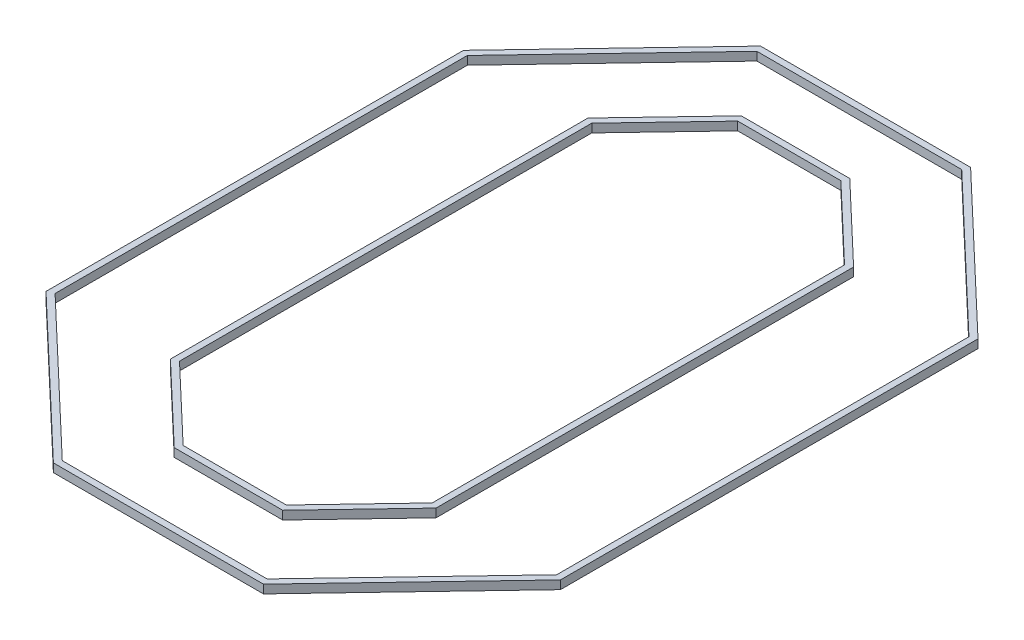
ISO-10303-21;
HEADER;
FILE_DESCRIPTION(('STEP AP214'),'2;1');
FILE_NAME('part.step','',(''),(''),'','','');
FILE_SCHEMA(('AUTOMOTIVE_DESIGN { 1 0 10303 214 1 1 1 1 }'));
ENDSEC;
DATA;
#1=APPLICATION_CONTEXT('core data for automotive mechanical design processes');
#2=APPLICATION_PROTOCOL_DEFINITION('international standard','automotive_design',2000,#1);
#3=PRODUCT_CONTEXT('',#1,'mechanical');
#4=PRODUCT('Part','Part','',(#3));
#5=PRODUCT_RELATED_PRODUCT_CATEGORY('part','',(#4));
#6=PRODUCT_DEFINITION_FORMATION('','',#4);
#7=PRODUCT_DEFINITION_CONTEXT('part definition',#1,'design');
#8=PRODUCT_DEFINITION('design','',#6,#7);
#9=PRODUCT_DEFINITION_SHAPE('','',#8);
#10=(LENGTH_UNIT() NAMED_UNIT(*) SI_UNIT(.MILLI.,.METRE.));
#11=(NAMED_UNIT(*) PLANE_ANGLE_UNIT() SI_UNIT($,.RADIAN.));
#12=(NAMED_UNIT(*) SI_UNIT($,.STERADIAN.) SOLID_ANGLE_UNIT());
#13=UNCERTAINTY_MEASURE_WITH_UNIT(LENGTH_MEASURE(1.E-05),#10,'distance_accuracy_value','');
#14=(GEOMETRIC_REPRESENTATION_CONTEXT(3) GLOBAL_UNCERTAINTY_ASSIGNED_CONTEXT((#13)) GLOBAL_UNIT_ASSIGNED_CONTEXT((#10,
#11,#12)) REPRESENTATION_CONTEXT('',''));
#15=CARTESIAN_POINT('',(0.,0.,0.));
#16=DIRECTION('',(0.,0.,1.));
#17=DIRECTION('',(1.,0.,0.));
#18=AXIS2_PLACEMENT_3D('',#15,#16,#17);
#19=CARTESIAN_POINT('',(-2041.11670156497,101.6,-1941.93514676379));
#20=DIRECTION('',(0.724489795918367,0.,0.689285525461084));
#21=DIRECTION('',(0.689285525461084,0.,-0.724489795918367));
#22=AXIS2_PLACEMENT_3D('',#19,#20,#21);
#23=PLANE('',#22);
#24=DIRECTION('',(-0.689285525461084,0.,0.724489795918367));
#25=VECTOR('',#24,1.);
#26=CARTESIAN_POINT('',(-2041.11670156497,0.,-1941.93514676379));
#27=LINE('',#26,#25);
#28=CARTESIAN_POINT('',(-651.340080352583,0.,-3402.69261733558));
#29=VERTEX_POINT('',#28);
#30=CARTESIAN_POINT('',(-1548.49261733558,0.,-2459.7193001581));
#31=VERTEX_POINT('',#30);
#32=EDGE_CURVE('E270',#29,#31,#27,.T.);
#33=ORIENTED_EDGE('',*,*,#32,.T.);
#34=DIRECTION('',(0.,-1.,0.));
#35=VECTOR('',#34,1.);
#36=CARTESIAN_POINT('',(-1548.49261733558,101.6,-2459.7193001581));
#37=LINE('',#36,#35);
#38=CARTESIAN_POINT('',(-1548.49261733558,101.6,-2459.7193001581));
#39=VERTEX_POINT('',#38);
#40=EDGE_CURVE('E13',#39,#31,#37,.T.);
#41=ORIENTED_EDGE('',*,*,#40,.F.);
#42=DIRECTION('',(-0.689285525461084,0.,0.724489795918367));
#43=VECTOR('',#42,1.);
#44=CARTESIAN_POINT('',(-2041.11670156497,101.6,-1941.93514676379));
#45=LINE('',#44,#43);
#46=CARTESIAN_POINT('',(-651.340080352583,101.6,-3402.69261733558));
#47=VERTEX_POINT('',#46);
#48=EDGE_CURVE('E350',#47,#39,#45,.T.);
#49=ORIENTED_EDGE('',*,*,#48,.F.);
#50=DIRECTION('',(0.,-1.,0.));
#51=VECTOR('',#50,1.);
#52=CARTESIAN_POINT('',(-651.340080352583,101.6,-3402.69261733558));
#53=LINE('',#52,#51);
#54=EDGE_CURVE('E289',#47,#29,#53,.T.);
#55=ORIENTED_EDGE('',*,*,#54,.T.);
#56=EDGE_LOOP('',(#33,#41,#49,#55));
#57=FACE_BOUND('',#56,.T.);
#58=ADVANCED_FACE('F99',(#57),#23,.F.);
#59=CARTESIAN_POINT('',(-1548.49261733558,101.6,-9.61033946544975E-13));
#60=DIRECTION('',(1.,0.,0.));
#61=DIRECTION('',(0.,0.,-1.));
#62=AXIS2_PLACEMENT_3D('',#59,#60,#61);
#63=PLANE('',#62);
#64=DIRECTION('',(0.,0.,1.));
#65=VECTOR('',#64,1.);
#66=CARTESIAN_POINT('',(-1548.49261733558,0.,-9.61033946544975E-13));
#67=LINE('',#66,#65);
#68=CARTESIAN_POINT('',(-1548.49261733558,0.,2550.24950383333));
#69=VERTEX_POINT('',#68);
#70=EDGE_CURVE('E273',#31,#69,#67,.T.);
#71=ORIENTED_EDGE('',*,*,#70,.T.);
#72=DIRECTION('',(0.,-1.,0.));
#73=VECTOR('',#72,1.);
#74=CARTESIAN_POINT('',(-1548.49261733558,101.6,2550.24950383333));
#75=LINE('',#74,#73);
#76=CARTESIAN_POINT('',(-1548.49261733558,101.6,2550.24950383333));
#77=VERTEX_POINT('',#76);
#78=EDGE_CURVE('E109',#77,#69,#75,.T.);
#79=ORIENTED_EDGE('',*,*,#78,.F.);
#80=DIRECTION('',(0.,0.,1.));
#81=VECTOR('',#80,1.);
#82=CARTESIAN_POINT('',(-1548.49261733558,101.6,-9.61033946544975E-13));
#83=LINE('',#82,#81);
#84=EDGE_CURVE('E352',#39,#77,#83,.T.);
#85=ORIENTED_EDGE('',*,*,#84,.F.);
#86=ORIENTED_EDGE('',*,*,#40,.T.);
#87=EDGE_LOOP('',(#71,#79,#85,#86));
#88=FACE_BOUND('',#87,.T.);
#89=ADVANCED_FACE('F384',(#88),#63,.F.);
#90=CARTESIAN_POINT('',(-2009.2557887482,101.6,2111.87564886733));
#91=DIRECTION('',(-0.689285525461084,0.,0.724489795918367));
#92=DIRECTION('',(0.724489795918367,0.,0.689285525461084));
#93=AXIS2_PLACEMENT_3D('',#90,#91,#92);
#94=PLANE('',#93);
#95=DIRECTION('',(-0.724489795918367,0.,-0.689285525461084));
#96=VECTOR('',#95,1.);
#97=CARTESIAN_POINT('',(-2009.2557887482,0.,2111.87564886733));
#98=LINE('',#97,#96);
#99=CARTESIAN_POINT('',(-605.519300158103,0.,3447.40204081633));
#100=VERTEX_POINT('',#99);
#101=EDGE_CURVE('E276',#100,#69,#98,.T.);
#102=ORIENTED_EDGE('',*,*,#101,.F.);
#103=DIRECTION('',(0.,-1.,0.));
#104=VECTOR('',#103,1.);
#105=CARTESIAN_POINT('',(-605.519300158103,101.6,3447.40204081633));
#106=LINE('',#105,#104);
#107=CARTESIAN_POINT('',(-605.519300158103,101.6,3447.40204081633));
#108=VERTEX_POINT('',#107);
#109=EDGE_CURVE('E295',#108,#100,#106,.T.);
#110=ORIENTED_EDGE('',*,*,#109,.F.);
#111=DIRECTION('',(-0.724489795918367,0.,-0.689285525461084));
#112=VECTOR('',#111,1.);
#113=CARTESIAN_POINT('',(-2009.2557887482,101.6,2111.87564886733));
#114=LINE('',#113,#112);
#115=EDGE_CURVE('E354',#108,#77,#114,.T.);
#116=ORIENTED_EDGE('',*,*,#115,.T.);
#117=ORIENTED_EDGE('',*,*,#78,.T.);
#118=EDGE_LOOP('',(#102,#110,#116,#117));
#119=FACE_BOUND('',#118,.T.);
#120=ADVANCED_FACE('F389',(#119),#94,.T.);
#121=CARTESIAN_POINT('',(0.,101.6,3447.40204081633));
#122=DIRECTION('',(0.,0.,1.));
#123=DIRECTION('',(1.,0.,0.));
#124=AXIS2_PLACEMENT_3D('',#121,#122,#123);
#125=PLANE('',#124);
#126=DIRECTION('',(-1.,0.,0.));
#127=VECTOR('',#126,1.);
#128=CARTESIAN_POINT('',(0.,0.,3447.40204081633));
#129=LINE('',#128,#127);
#130=CARTESIAN_POINT('',(696.049503833336,0.,3447.40204081633));
#131=VERTEX_POINT('',#130);
#132=EDGE_CURVE('E279',#131,#100,#129,.T.);
#133=ORIENTED_EDGE('',*,*,#132,.F.);
#134=DIRECTION('',(0.,-1.,0.));
#135=VECTOR('',#134,1.);
#136=CARTESIAN_POINT('',(696.049503833336,101.6,3447.40204081633));
#137=LINE('',#136,#135);
#138=CARTESIAN_POINT('',(696.049503833336,101.6,3447.40204081633));
#139=VERTEX_POINT('',#138);
#140=EDGE_CURVE('E293',#139,#131,#137,.T.);
#141=ORIENTED_EDGE('',*,*,#140,.F.);
#142=DIRECTION('',(-1.,0.,0.));
#143=VECTOR('',#142,1.);
#144=CARTESIAN_POINT('',(0.,101.6,3447.40204081633));
#145=LINE('',#144,#143);
#146=EDGE_CURVE('E243',#139,#108,#145,.T.);
#147=ORIENTED_EDGE('',*,*,#146,.T.);
#148=ORIENTED_EDGE('',*,*,#109,.T.);
#149=EDGE_LOOP('',(#133,#141,#147,#148));
#150=FACE_BOUND('',#149,.T.);
#151=ADVANCED_FACE('F359',(#150),#125,.T.);
#152=CARTESIAN_POINT('',(2086.91103470847,101.6,1985.50425037545));
#153=DIRECTION('',(0.724489795918368,0.,0.689285525461083));
#154=DIRECTION('',(0.689285525461083,0.,-0.724489795918368));
#155=AXIS2_PLACEMENT_3D('',#152,#153,#154);
#156=PLANE('',#155);
#157=DIRECTION('',(-0.689285525461083,0.,0.724489795918368));
#158=VECTOR('',#157,1.);
#159=CARTESIAN_POINT('',(2086.91103470847,0.,1985.50425037545));
#160=LINE('',#159,#158);
#161=CARTESIAN_POINT('',(1593.20204081633,0.,2504.42872363886));
#162=VERTEX_POINT('',#161);
#163=EDGE_CURVE('E282',#162,#131,#160,.T.);
#164=ORIENTED_EDGE('',*,*,#163,.F.);
#165=DIRECTION('',(0.,-1.,0.));
#166=VECTOR('',#165,1.);
#167=CARTESIAN_POINT('',(1593.20204081633,101.6,2504.42872363886));
#168=LINE('',#167,#166);
#169=CARTESIAN_POINT('',(1593.20204081633,101.6,2504.42872363886));
#170=VERTEX_POINT('',#169);
#171=EDGE_CURVE('E231',#170,#162,#168,.T.);
#172=ORIENTED_EDGE('',*,*,#171,.F.);
#173=DIRECTION('',(-0.689285525461083,0.,0.724489795918368));
#174=VECTOR('',#173,1.);
#175=CARTESIAN_POINT('',(2086.91103470847,101.6,1985.50425037545));
#176=LINE('',#175,#174);
#177=EDGE_CURVE('E241',#170,#139,#176,.T.);
#178=ORIENTED_EDGE('',*,*,#177,.T.);
#179=ORIENTED_EDGE('',*,*,#140,.T.);
#180=EDGE_LOOP('',(#164,#172,#178,#179));
#181=FACE_BOUND('',#180,.T.);
#182=ADVANCED_FACE('F364',(#181),#156,.T.);
#183=CARTESIAN_POINT('',(1593.20204081633,101.6,0.));
#184=DIRECTION('',(1.,0.,0.));
#185=DIRECTION('',(0.,0.,-1.));
#186=AXIS2_PLACEMENT_3D('',#183,#184,#185);
#187=PLANE('',#186);
#188=DIRECTION('',(0.,0.,1.));
#189=VECTOR('',#188,1.);
#190=CARTESIAN_POINT('',(1593.20204081633,0.,0.));
#191=LINE('',#190,#189);
#192=CARTESIAN_POINT('',(1593.20204081633,0.,-2505.54008035258));
#193=VERTEX_POINT('',#192);
#194=EDGE_CURVE('E230',#193,#162,#191,.T.);
#195=ORIENTED_EDGE('',*,*,#194,.F.);
#196=DIRECTION('',(0.,-1.,0.));
#197=VECTOR('',#196,1.);
#198=CARTESIAN_POINT('',(1593.20204081633,101.6,-2505.54008035258));
#199=LINE('',#198,#197);
#200=CARTESIAN_POINT('',(1593.20204081633,101.6,-2505.54008035258));
#201=VERTEX_POINT('',#200);
#202=EDGE_CURVE('E224',#201,#193,#199,.T.);
#203=ORIENTED_EDGE('',*,*,#202,.F.);
#204=DIRECTION('',(0.,0.,1.));
#205=VECTOR('',#204,1.);
#206=CARTESIAN_POINT('',(1593.20204081633,101.6,0.));
#207=LINE('',#206,#205);
#208=EDGE_CURVE('E228',#201,#170,#207,.T.);
#209=ORIENTED_EDGE('',*,*,#208,.T.);
#210=ORIENTED_EDGE('',*,*,#171,.T.);
#211=EDGE_LOOP('',(#195,#203,#209,#210));
#212=FACE_BOUND('',#211,.T.);
#213=ADVANCED_FACE('F226',(#212),#187,.T.);
#214=CARTESIAN_POINT('',(2008.17087908545,101.6,-2110.73532899824));
#215=DIRECTION('',(-0.689285525461084,0.,0.724489795918367));
#216=DIRECTION('',(0.724489795918368,0.,0.689285525461084));
#217=AXIS2_PLACEMENT_3D('',#214,#215,#216);
#218=PLANE('',#217);
#219=DIRECTION('',(-0.724489795918368,0.,-0.689285525461084));
#220=VECTOR('',#219,1.);
#221=CARTESIAN_POINT('',(2008.17087908545,0.,-2110.73532899824));
#222=LINE('',#221,#220);
#223=CARTESIAN_POINT('',(650.228723638856,0.,-3402.69261733558));
#224=VERTEX_POINT('',#223);
#225=EDGE_CURVE('E170',#193,#224,#222,.T.);
#226=ORIENTED_EDGE('',*,*,#225,.T.);
#227=DIRECTION('',(0.,-1.,0.));
#228=VECTOR('',#227,1.);
#229=CARTESIAN_POINT('',(650.228723638856,101.6,-3402.69261733558));
#230=LINE('',#229,#228);
#231=CARTESIAN_POINT('',(650.228723638856,101.6,-3402.69261733558));
#232=VERTEX_POINT('',#231);
#233=EDGE_CURVE('E232',#232,#224,#230,.T.);
#234=ORIENTED_EDGE('',*,*,#233,.F.);
#235=DIRECTION('',(-0.724489795918368,0.,-0.689285525461084));
#236=VECTOR('',#235,1.);
#237=CARTESIAN_POINT('',(2008.17087908545,101.6,-2110.73532899824));
#238=LINE('',#237,#236);
#239=EDGE_CURVE('E234',#201,#232,#238,.T.);
#240=ORIENTED_EDGE('',*,*,#239,.F.);
#241=ORIENTED_EDGE('',*,*,#202,.T.);
#242=EDGE_LOOP('',(#226,#234,#240,#241));
#243=FACE_BOUND('',#242,.T.);
#244=ADVANCED_FACE('F235',(#243),#218,.F.);
#245=CARTESIAN_POINT('',(-1472.29261733558,101.6,-9.24991510498918E-13));
#246=DIRECTION('',(1.,0.,0.));
#247=DIRECTION('',(0.,0.,-1.));
#248=AXIS2_PLACEMENT_3D('',#245,#246,#247);
#249=PLANE('',#248);
#250=DIRECTION('',(0.,0.,1.));
#251=VECTOR('',#250,1.);
#252=CARTESIAN_POINT('',(-1472.29261733558,0.,-9.24991510498918E-13));
#253=LINE('',#252,#251);
#254=CARTESIAN_POINT('',(-1472.29261733558,0.,-2429.26185288039));
#255=VERTEX_POINT('',#254);
#256=CARTESIAN_POINT('',(-1472.29261733558,0.,2517.56934312816));
#257=VERTEX_POINT('',#256);
#258=EDGE_CURVE('E249',#255,#257,#253,.T.);
#259=ORIENTED_EDGE('',*,*,#258,.F.);
#260=DIRECTION('',(0.,-1.,0.));
#261=VECTOR('',#260,1.);
#262=CARTESIAN_POINT('',(-1472.29261733558,101.6,-2429.26185288039));
#263=LINE('',#262,#261);
#264=CARTESIAN_POINT('',(-1472.29261733558,101.6,-2429.26185288039));
#265=VERTEX_POINT('',#264);
#266=EDGE_CURVE('E103',#265,#255,#263,.T.);
#267=ORIENTED_EDGE('',*,*,#266,.F.);
#268=DIRECTION('',(0.,0.,1.));
#269=VECTOR('',#268,1.);
#270=CARTESIAN_POINT('',(-1472.29261733558,101.6,-9.24991510498918E-13));
#271=LINE('',#270,#269);
#272=CARTESIAN_POINT('',(-1472.29261733558,101.6,2517.56934312816));
#273=VERTEX_POINT('',#272);
#274=EDGE_CURVE('E288',#265,#273,#271,.T.);
#275=ORIENTED_EDGE('',*,*,#274,.T.);
#276=DIRECTION('',(0.,-1.,0.));
#277=VECTOR('',#276,1.);
#278=CARTESIAN_POINT('',(-1472.29261733558,101.6,2517.56934312816));
#279=LINE('',#278,#277);
#280=EDGE_CURVE('E248',#273,#257,#279,.T.);
#281=ORIENTED_EDGE('',*,*,#280,.T.);
#282=EDGE_LOOP('',(#259,#267,#275,#281));
#283=FACE_BOUND('',#282,.T.);
#284=ADVANCED_FACE('F101',(#283),#249,.T.);
#285=CARTESIAN_POINT('',(-1985.91057911599,101.6,-1889.41158972365));
#286=DIRECTION('',(0.724489795918367,0.,0.689285525461084));
#287=DIRECTION('',(0.689285525461084,0.,-0.724489795918368));
#288=AXIS2_PLACEMENT_3D('',#285,#286,#287);
#289=PLANE('',#288);
#290=DIRECTION('',(-0.689285525461084,0.,0.724489795918368));
#291=VECTOR('',#290,1.);
#292=CARTESIAN_POINT('',(-1985.91057911599,0.,-1889.41158972365));
#293=LINE('',#292,#291);
#294=CARTESIAN_POINT('',(-618.659919647417,0.,-3326.49261733558));
#295=VERTEX_POINT('',#294);
#296=EDGE_CURVE('E252',#295,#255,#293,.T.);
#297=ORIENTED_EDGE('',*,*,#296,.F.);
#298=DIRECTION('',(0.,-1.,0.));
#299=VECTOR('',#298,1.);
#300=CARTESIAN_POINT('',(-618.659919647417,101.6,-3326.49261733558));
#301=LINE('',#300,#299);
#302=CARTESIAN_POINT('',(-618.659919647417,101.6,-3326.49261733558));
#303=VERTEX_POINT('',#302);
#304=EDGE_CURVE('E311',#303,#295,#301,.T.);
#305=ORIENTED_EDGE('',*,*,#304,.F.);
#306=DIRECTION('',(-0.689285525461084,0.,0.724489795918368));
#307=VECTOR('',#306,1.);
#308=CARTESIAN_POINT('',(-1985.91057911599,101.6,-1889.41158972365));
#309=LINE('',#308,#307);
#310=EDGE_CURVE('E320',#303,#265,#309,.T.);
#311=ORIENTED_EDGE('',*,*,#310,.T.);
#312=ORIENTED_EDGE('',*,*,#266,.T.);
#313=EDGE_LOOP('',(#297,#305,#311,#312));
#314=FACE_BOUND('',#313,.T.);
#315=ADVANCED_FACE('F318',(#314),#289,.T.);
#316=CARTESIAN_POINT('',(0.,101.6,-3326.49261733558));
#317=DIRECTION('',(0.,0.,1.));
#318=DIRECTION('',(1.,0.,0.));
#319=AXIS2_PLACEMENT_3D('',#316,#317,#318);
#320=PLANE('',#319);
#321=DIRECTION('',(-1.,0.,0.));
#322=VECTOR('',#321,1.);
#323=CARTESIAN_POINT('',(0.,0.,-3326.49261733558));
#324=LINE('',#323,#322);
#325=CARTESIAN_POINT('',(619.771276361145,0.,-3326.49261733558));
#326=VERTEX_POINT('',#325);
#327=EDGE_CURVE('E255',#326,#295,#324,.T.);
#328=ORIENTED_EDGE('',*,*,#327,.F.);
#329=DIRECTION('',(0.,-1.,0.));
#330=VECTOR('',#329,1.);
#331=CARTESIAN_POINT('',(619.771276361145,101.6,-3326.49261733558));
#332=LINE('',#331,#330);
#333=CARTESIAN_POINT('',(619.771276361145,101.6,-3326.49261733558));
#334=VERTEX_POINT('',#333);
#335=EDGE_CURVE('E310',#334,#326,#332,.T.);
#336=ORIENTED_EDGE('',*,*,#335,.F.);
#337=DIRECTION('',(-1.,0.,0.));
#338=VECTOR('',#337,1.);
#339=CARTESIAN_POINT('',(0.,101.6,-3326.49261733558));
#340=LINE('',#339,#338);
#341=EDGE_CURVE('E330',#334,#303,#340,.T.);
#342=ORIENTED_EDGE('',*,*,#341,.T.);
#343=ORIENTED_EDGE('',*,*,#304,.T.);
#344=EDGE_LOOP('',(#328,#336,#342,#343));
#345=FACE_BOUND('',#344,.T.);
#346=ADVANCED_FACE('F328',(#345),#320,.T.);
#347=CARTESIAN_POINT('',(1955.64732204532,101.6,-2055.52920654926));
#348=DIRECTION('',(-0.689285525461083,0.,0.724489795918368));
#349=DIRECTION('',(0.724489795918368,0.,0.689285525461084));
#350=AXIS2_PLACEMENT_3D('',#347,#348,#349);
#351=PLANE('',#350);
#352=DIRECTION('',(-0.724489795918368,0.,-0.689285525461084));
#353=VECTOR('',#352,1.);
#354=CARTESIAN_POINT('',(1955.64732204532,0.,-2055.52920654926));
#355=LINE('',#354,#353);
#356=CARTESIAN_POINT('',(1517.00204081633,0.,-2472.85991964742));
#357=VERTEX_POINT('',#356);
#358=EDGE_CURVE('E258',#357,#326,#355,.T.);
#359=ORIENTED_EDGE('',*,*,#358,.F.);
#360=DIRECTION('',(0.,-1.,0.));
#361=VECTOR('',#360,1.);
#362=CARTESIAN_POINT('',(1517.00204081633,101.6,-2472.85991964742));
#363=LINE('',#362,#361);
#364=CARTESIAN_POINT('',(1517.00204081633,101.6,-2472.85991964742));
#365=VERTEX_POINT('',#364);
#366=EDGE_CURVE('E308',#365,#357,#363,.T.);
#367=ORIENTED_EDGE('',*,*,#366,.F.);
#368=DIRECTION('',(-0.724489795918368,0.,-0.689285525461084));
#369=VECTOR('',#368,1.);
#370=CARTESIAN_POINT('',(1955.64732204532,101.6,-2055.52920654926));
#371=LINE('',#370,#369);
#372=EDGE_CURVE('E335',#365,#334,#371,.T.);
#373=ORIENTED_EDGE('',*,*,#372,.T.);
#374=ORIENTED_EDGE('',*,*,#335,.T.);
#375=EDGE_LOOP('',(#359,#367,#373,#374));
#376=FACE_BOUND('',#375,.T.);
#377=ADVANCED_FACE('F337',(#376),#351,.T.);
#378=CARTESIAN_POINT('',(1517.00204081633,101.6,-5.44862434215934E-13));
#379=DIRECTION('',(1.,0.,0.));
#380=DIRECTION('',(0.,0.,-1.));
#381=AXIS2_PLACEMENT_3D('',#378,#379,#380);
#382=PLANE('',#381);
#383=DIRECTION('',(0.,0.,1.));
#384=VECTOR('',#383,1.);
#385=CARTESIAN_POINT('',(1517.00204081633,0.,-5.44862434215934E-13));
#386=LINE('',#385,#384);
#387=CARTESIAN_POINT('',(1517.00204081633,0.,2473.97127636114));
#388=VERTEX_POINT('',#387);
#389=EDGE_CURVE('E261',#357,#388,#386,.T.);
#390=ORIENTED_EDGE('',*,*,#389,.T.);
#391=DIRECTION('',(0.,-1.,0.));
#392=VECTOR('',#391,1.);
#393=CARTESIAN_POINT('',(1517.00204081633,101.6,2473.97127636114));
#394=LINE('',#393,#392);
#395=CARTESIAN_POINT('',(1517.00204081633,101.6,2473.97127636114));
#396=VERTEX_POINT('',#395);
#397=EDGE_CURVE('E305',#396,#388,#394,.T.);
#398=ORIENTED_EDGE('',*,*,#397,.F.);
#399=DIRECTION('',(0.,0.,1.));
#400=VECTOR('',#399,1.);
#401=CARTESIAN_POINT('',(1517.00204081633,101.6,-5.44862434215934E-13));
#402=LINE('',#401,#400);
#403=EDGE_CURVE('E339',#365,#396,#402,.T.);
#404=ORIENTED_EDGE('',*,*,#403,.F.);
#405=ORIENTED_EDGE('',*,*,#366,.T.);
#406=EDGE_LOOP('',(#390,#398,#404,#405));
#407=FACE_BOUND('',#406,.T.);
#408=ADVANCED_FACE('F400',(#407),#382,.F.);
#409=CARTESIAN_POINT('',(2031.70491225949,101.6,1932.98069333532));
#410=DIRECTION('',(0.724489795918368,0.,0.689285525461083));
#411=DIRECTION('',(0.689285525461083,0.,-0.724489795918368));
#412=AXIS2_PLACEMENT_3D('',#409,#410,#411);
#413=PLANE('',#412);
#414=DIRECTION('',(-0.689285525461083,0.,0.724489795918368));
#415=VECTOR('',#414,1.);
#416=CARTESIAN_POINT('',(2031.70491225949,0.,1932.98069333532));
#417=LINE('',#416,#415);
#418=CARTESIAN_POINT('',(663.369343128169,0.,3371.20204081633));
#419=VERTEX_POINT('',#418);
#420=EDGE_CURVE('E263',#388,#419,#417,.T.);
#421=ORIENTED_EDGE('',*,*,#420,.T.);
#422=DIRECTION('',(0.,-1.,0.));
#423=VECTOR('',#422,1.);
#424=CARTESIAN_POINT('',(663.369343128169,101.6,3371.20204081633));
#425=LINE('',#424,#423);
#426=CARTESIAN_POINT('',(663.369343128169,101.6,3371.20204081633));
#427=VERTEX_POINT('',#426);
#428=EDGE_CURVE('E302',#427,#419,#425,.T.);
#429=ORIENTED_EDGE('',*,*,#428,.F.);
#430=DIRECTION('',(-0.689285525461083,0.,0.724489795918368));
#431=VECTOR('',#430,1.);
#432=CARTESIAN_POINT('',(2031.70491225949,101.6,1932.98069333532));
#433=LINE('',#432,#431);
#434=EDGE_CURVE('E341',#396,#427,#433,.T.);
#435=ORIENTED_EDGE('',*,*,#434,.F.);
#436=ORIENTED_EDGE('',*,*,#397,.T.);
#437=EDGE_LOOP('',(#421,#429,#435,#436));
#438=FACE_BOUND('',#437,.T.);
#439=ADVANCED_FACE('F396',(#438),#413,.F.);
#440=CARTESIAN_POINT('',(0.,101.6,3371.20204081633));
#441=DIRECTION('',(0.,0.,1.));
#442=DIRECTION('',(1.,0.,0.));
#443=AXIS2_PLACEMENT_3D('',#440,#441,#442);
#444=PLANE('',#443);
#445=DIRECTION('',(-1.,0.,0.));
#446=VECTOR('',#445,1.);
#447=CARTESIAN_POINT('',(0.,0.,3371.20204081633));
#448=LINE('',#447,#446);
#449=CARTESIAN_POINT('',(-575.061852880392,0.,3371.20204081633));
#450=VERTEX_POINT('',#449);
#451=EDGE_CURVE('E265',#419,#450,#448,.T.);
#452=ORIENTED_EDGE('',*,*,#451,.T.);
#453=DIRECTION('',(0.,-1.,0.));
#454=VECTOR('',#453,1.);
#455=CARTESIAN_POINT('',(-575.061852880392,101.6,3371.20204081633));
#456=LINE('',#455,#454);
#457=CARTESIAN_POINT('',(-575.061852880392,101.6,3371.20204081633));
#458=VERTEX_POINT('',#457);
#459=EDGE_CURVE('E299',#458,#450,#456,.T.);
#460=ORIENTED_EDGE('',*,*,#459,.F.);
#461=DIRECTION('',(-1.,0.,0.));
#462=VECTOR('',#461,1.);
#463=CARTESIAN_POINT('',(0.,101.6,3371.20204081633));
#464=LINE('',#463,#462);
#465=EDGE_CURVE('E346',#427,#458,#464,.T.);
#466=ORIENTED_EDGE('',*,*,#465,.F.);
#467=ORIENTED_EDGE('',*,*,#428,.T.);
#468=EDGE_LOOP('',(#452,#460,#466,#467));
#469=FACE_BOUND('',#468,.T.);
#470=ADVANCED_FACE('F378',(#469),#444,.F.);
#471=CARTESIAN_POINT('',(-1956.73223170807,101.6,2056.66952641835));
#472=DIRECTION('',(-0.689285525461084,0.,0.724489795918367));
#473=DIRECTION('',(0.724489795918368,0.,0.689285525461084));
#474=AXIS2_PLACEMENT_3D('',#471,#472,#473);
#475=PLANE('',#474);
#476=DIRECTION('',(-0.724489795918368,0.,-0.689285525461084));
#477=VECTOR('',#476,1.);
#478=CARTESIAN_POINT('',(-1956.73223170807,0.,2056.66952641835));
#479=LINE('',#478,#477);
#480=EDGE_CURVE('E267',#450,#257,#479,.T.);
#481=ORIENTED_EDGE('',*,*,#480,.T.);
#482=ORIENTED_EDGE('',*,*,#280,.F.);
#483=DIRECTION('',(-0.724489795918368,0.,-0.689285525461084));
#484=VECTOR('',#483,1.);
#485=CARTESIAN_POINT('',(-1956.73223170807,101.6,2056.66952641835));
#486=LINE('',#485,#484);
#487=EDGE_CURVE('E348',#458,#273,#486,.T.);
#488=ORIENTED_EDGE('',*,*,#487,.F.);
#489=ORIENTED_EDGE('',*,*,#459,.T.);
#490=EDGE_LOOP('',(#481,#482,#488,#489));
#491=FACE_BOUND('',#490,.T.);
#492=ADVANCED_FACE('F371',(#491),#475,.F.);
#493=CARTESIAN_POINT('',(0.,101.6,-3402.69261733558));
#494=DIRECTION('',(0.,0.,1.));
#495=DIRECTION('',(1.,0.,0.));
#496=AXIS2_PLACEMENT_3D('',#493,#494,#495);
#497=PLANE('',#496);
#498=DIRECTION('',(-1.,0.,0.));
#499=VECTOR('',#498,1.);
#500=CARTESIAN_POINT('',(0.,0.,-3402.69261733558));
#501=LINE('',#500,#499);
#502=EDGE_CURVE('E176',#224,#29,#501,.T.);
#503=ORIENTED_EDGE('',*,*,#502,.T.);
#504=ORIENTED_EDGE('',*,*,#54,.F.);
#505=DIRECTION('',(-1.,0.,0.));
#506=VECTOR('',#505,1.);
#507=CARTESIAN_POINT('',(0.,101.6,-3402.69261733558));
#508=LINE('',#507,#506);
#509=EDGE_CURVE('E118',#232,#47,#508,.T.);
#510=ORIENTED_EDGE('',*,*,#509,.F.);
#511=ORIENTED_EDGE('',*,*,#233,.T.);
#512=EDGE_LOOP('',(#503,#504,#510,#511));
#513=FACE_BOUND('',#512,.T.);
#514=ADVANCED_FACE('F369',(#513),#497,.F.);
#515=CARTESIAN_POINT('',(0.,101.6,0.));
#516=DIRECTION('',(0.,1.,0.));
#517=DIRECTION('',(0.,0.,1.));
#518=AXIS2_PLACEMENT_3D('',#515,#516,#517);
#519=PLANE('',#518);
#520=ORIENTED_EDGE('',*,*,#274,.F.);
#521=ORIENTED_EDGE('',*,*,#310,.F.);
#522=ORIENTED_EDGE('',*,*,#341,.F.);
#523=ORIENTED_EDGE('',*,*,#372,.F.);
#524=ORIENTED_EDGE('',*,*,#403,.T.);
#525=ORIENTED_EDGE('',*,*,#434,.T.);
#526=ORIENTED_EDGE('',*,*,#465,.T.);
#527=ORIENTED_EDGE('',*,*,#487,.T.);
#528=EDGE_LOOP('',(#520,#521,#522,#523,#524,#525,#526,#527));
#529=FACE_BOUND('',#528,.T.);
#530=ORIENTED_EDGE('',*,*,#48,.T.);
#531=ORIENTED_EDGE('',*,*,#84,.T.);
#532=ORIENTED_EDGE('',*,*,#115,.F.);
#533=ORIENTED_EDGE('',*,*,#146,.F.);
#534=ORIENTED_EDGE('',*,*,#177,.F.);
#535=ORIENTED_EDGE('',*,*,#208,.F.);
#536=ORIENTED_EDGE('',*,*,#239,.T.);
#537=ORIENTED_EDGE('',*,*,#509,.T.);
#538=EDGE_LOOP('',(#530,#531,#532,#533,#534,#535,#536,#537));
#539=FACE_BOUND('',#538,.T.);
#540=ADVANCED_FACE('F238',(#529,#539),#519,.T.);
#541=CARTESIAN_POINT('',(0.,0.,0.));
#542=DIRECTION('',(0.,1.,0.));
#543=DIRECTION('',(0.,0.,1.));
#544=AXIS2_PLACEMENT_3D('',#541,#542,#543);
#545=PLANE('',#544);
#546=ORIENTED_EDGE('',*,*,#258,.T.);
#547=ORIENTED_EDGE('',*,*,#480,.F.);
#548=ORIENTED_EDGE('',*,*,#451,.F.);
#549=ORIENTED_EDGE('',*,*,#420,.F.);
#550=ORIENTED_EDGE('',*,*,#389,.F.);
#551=ORIENTED_EDGE('',*,*,#358,.T.);
#552=ORIENTED_EDGE('',*,*,#327,.T.);
#553=ORIENTED_EDGE('',*,*,#296,.T.);
#554=EDGE_LOOP('',(#546,#547,#548,#549,#550,#551,#552,#553));
#555=FACE_BOUND('',#554,.T.);
#556=ORIENTED_EDGE('',*,*,#32,.F.);
#557=ORIENTED_EDGE('',*,*,#502,.F.);
#558=ORIENTED_EDGE('',*,*,#225,.F.);
#559=ORIENTED_EDGE('',*,*,#194,.T.);
#560=ORIENTED_EDGE('',*,*,#163,.T.);
#561=ORIENTED_EDGE('',*,*,#132,.T.);
#562=ORIENTED_EDGE('',*,*,#101,.T.);
#563=ORIENTED_EDGE('',*,*,#70,.F.);
#564=EDGE_LOOP('',(#556,#557,#558,#559,#560,#561,#562,#563));
#565=FACE_BOUND('',#564,.T.);
#566=ADVANCED_FACE('F324',(#555,#565),#545,.F.);
#567=CLOSED_SHELL('',(#58,#89,#120,#151,#182,#213,#244,#284,#315,#346,#377,#408,#439,#470,#492,
#514,#540,#566));
#568=MANIFOLD_SOLID_BREP('B2',#567);
#569=CARTESIAN_POINT('',(-2667.07126557522,101.6,2803.28810851466));
#570=DIRECTION('',(-0.689285525461084,0.,0.724489795918367));
#571=DIRECTION('',(0.724489795918367,0.,0.689285525461084));
#572=AXIS2_PLACEMENT_3D('',#569,#570,#571);
#573=PLANE('',#572);
#574=DIRECTION('',(-0.724489795918367,0.,-0.689285525461084));
#575=VECTOR('',#574,1.);
#576=CARTESIAN_POINT('',(-2667.07126557522,0.,2803.28810851466));
#577=LINE('',#576,#575);
#578=CARTESIAN_POINT('',(-1141.74080633887,0.,4254.5));
#579=VERTEX_POINT('',#578);
#580=CARTESIAN_POINT('',(-2922.26952997773,0.,2560.49038966969));
#581=VERTEX_POINT('',#580);
#582=EDGE_CURVE('E721',#579,#581,#577,.T.);
#583=ORIENTED_EDGE('',*,*,#582,.T.);
#584=DIRECTION('',(0.,-1.,0.));
#585=VECTOR('',#584,1.);
#586=CARTESIAN_POINT('',(-2922.26952997773,101.6,2560.49038966969));
#587=LINE('',#586,#585);
#588=CARTESIAN_POINT('',(-2922.26952997773,101.6,2560.49038966969));
#589=VERTEX_POINT('',#588);
#590=EDGE_CURVE('E97',#589,#581,#587,.T.);
#591=ORIENTED_EDGE('',*,*,#590,.F.);
#592=DIRECTION('',(-0.724489795918367,0.,-0.689285525461084));
#593=VECTOR('',#592,1.);
#594=CARTESIAN_POINT('',(-2667.07126557522,101.6,2803.28810851466));
#595=LINE('',#594,#593);
#596=CARTESIAN_POINT('',(-1141.74080633887,101.6,4254.5));
#597=VERTEX_POINT('',#596);
#598=EDGE_CURVE('E799',#597,#589,#595,.T.);
#599=ORIENTED_EDGE('',*,*,#598,.F.);
#600=DIRECTION('',(0.,-1.,0.));
#601=VECTOR('',#600,1.);
#602=CARTESIAN_POINT('',(-1141.74080633887,101.6,4254.5));
#603=LINE('',#602,#601);
#604=EDGE_CURVE('E736',#597,#579,#603,.T.);
#605=ORIENTED_EDGE('',*,*,#604,.T.);
#606=EDGE_LOOP('',(#583,#591,#599,#605));
#607=FACE_BOUND('',#606,.T.);
#608=ADVANCED_FACE('F549',(#607),#573,.F.);
#609=CARTESIAN_POINT('',(-2922.26952997773,101.6,1.04959310976398E-12));
#610=DIRECTION('',(-1.,0.,0.));
#611=DIRECTION('',(0.,0.,1.));
#612=AXIS2_PLACEMENT_3D('',#609,#610,#611);
#613=PLANE('',#612);
#614=DIRECTION('',(0.,0.,-1.));
#615=VECTOR('',#614,1.);
#616=CARTESIAN_POINT('',(-2922.26952997773,0.,1.04959310976398E-12));
#617=LINE('',#616,#615);
#618=CARTESIAN_POINT('',(-2922.26952997773,0.,-2386.34080633887));
#619=VERTEX_POINT('',#618);
#620=EDGE_CURVE('E724',#581,#619,#617,.T.);
#621=ORIENTED_EDGE('',*,*,#620,.T.);
#622=DIRECTION('',(0.,-1.,0.));
#623=VECTOR('',#622,1.);
#624=CARTESIAN_POINT('',(-2922.26952997773,101.6,-2386.34080633887));
#625=LINE('',#624,#623);
#626=CARTESIAN_POINT('',(-2922.26952997773,101.6,-2386.34080633887));
#627=VERTEX_POINT('',#626);
#628=EDGE_CURVE('E559',#627,#619,#625,.T.);
#629=ORIENTED_EDGE('',*,*,#628,.F.);
#630=DIRECTION('',(0.,0.,-1.));
#631=VECTOR('',#630,1.);
#632=CARTESIAN_POINT('',(-2922.26952997773,101.6,1.04959310976398E-12));
#633=LINE('',#632,#631);
#634=EDGE_CURVE('E801',#589,#627,#633,.T.);
#635=ORIENTED_EDGE('',*,*,#634,.F.);
#636=ORIENTED_EDGE('',*,*,#590,.T.);
#637=EDGE_LOOP('',(#621,#629,#635,#636));
#638=FACE_BOUND('',#637,.T.);
#639=ADVANCED_FACE('F836',(#638),#613,.F.);
#640=CARTESIAN_POINT('',(-2725.54845789099,101.6,-2593.10912527844));
#641=DIRECTION('',(-0.724489795918367,0.,-0.689285525461084));
#642=DIRECTION('',(-0.689285525461084,0.,0.724489795918368));
#643=AXIS2_PLACEMENT_3D('',#640,#641,#642);
#644=PLANE('',#643);
#645=DIRECTION('',(0.689285525461084,0.,-0.724489795918368));
#646=VECTOR('',#645,1.);
#647=CARTESIAN_POINT('',(-2725.54845789099,0.,-2593.10912527844));
#648=LINE('',#647,#646);
#649=CARTESIAN_POINT('',(-1228.25991964742,0.,-4166.86952997773));
#650=VERTEX_POINT('',#649);
#651=EDGE_CURVE('E726',#619,#650,#648,.T.);
#652=ORIENTED_EDGE('',*,*,#651,.T.);
#653=DIRECTION('',(0.,-1.,0.));
#654=VECTOR('',#653,1.);
#655=CARTESIAN_POINT('',(-1228.25991964742,101.6,-4166.86952997773));
#656=LINE('',#655,#654);
#657=CARTESIAN_POINT('',(-1228.25991964742,101.6,-4166.86952997773));
#658=VERTEX_POINT('',#657);
#659=EDGE_CURVE('E743',#658,#650,#656,.T.);
#660=ORIENTED_EDGE('',*,*,#659,.F.);
#661=DIRECTION('',(0.689285525461084,0.,-0.724489795918368));
#662=VECTOR('',#661,1.);
#663=CARTESIAN_POINT('',(-2725.54845789099,101.6,-2593.10912527844));
#664=LINE('',#663,#662);
#665=EDGE_CURVE('E803',#627,#658,#664,.T.);
#666=ORIENTED_EDGE('',*,*,#665,.F.);
#667=ORIENTED_EDGE('',*,*,#628,.T.);
#668=EDGE_LOOP('',(#652,#660,#666,#667));
#669=FACE_BOUND('',#668,.T.);
#670=ADVANCED_FACE('F841',(#669),#644,.F.);
#671=CARTESIAN_POINT('',(0.,101.6,-4166.86952997773));
#672=DIRECTION('',(0.,0.,-1.));
#673=DIRECTION('',(-1.,0.,0.));
#674=AXIS2_PLACEMENT_3D('',#671,#672,#673);
#675=PLANE('',#674);
#676=DIRECTION('',(1.,0.,0.));
#677=VECTOR('',#676,1.);
#678=CARTESIAN_POINT('',(0.,0.,-4166.86952997773));
#679=LINE('',#678,#677);
#680=CARTESIAN_POINT('',(1229.37127636114,0.,-4166.86952997773));
#681=VERTEX_POINT('',#680);
#682=EDGE_CURVE('E728',#650,#681,#679,.T.);
#683=ORIENTED_EDGE('',*,*,#682,.T.);
#684=DIRECTION('',(0.,-1.,0.));
#685=VECTOR('',#684,1.);
#686=CARTESIAN_POINT('',(1229.37127636114,101.6,-4166.86952997773));
#687=LINE('',#686,#685);
#688=CARTESIAN_POINT('',(1229.37127636114,101.6,-4166.86952997773));
#689=VERTEX_POINT('',#688);
#690=EDGE_CURVE('E740',#689,#681,#687,.T.);
#691=ORIENTED_EDGE('',*,*,#690,.F.);
#692=DIRECTION('',(1.,0.,0.));
#693=VECTOR('',#692,1.);
#694=CARTESIAN_POINT('',(0.,101.6,-4166.86952997773));
#695=LINE('',#694,#693);
#696=EDGE_CURVE('E805',#658,#689,#695,.T.);
#697=ORIENTED_EDGE('',*,*,#696,.F.);
#698=ORIENTED_EDGE('',*,*,#659,.T.);
#699=EDGE_LOOP('',(#683,#691,#697,#698));
#700=FACE_BOUND('',#699,.T.);
#701=ADVANCED_FACE('F811',(#700),#675,.F.);
#702=CARTESIAN_POINT('',(2664.94484263623,101.6,-2801.05308157125));
#703=DIRECTION('',(0.689285525461084,0.,-0.724489795918368));
#704=DIRECTION('',(-0.724489795918368,0.,-0.689285525461084));
#705=AXIS2_PLACEMENT_3D('',#702,#703,#704);
#706=PLANE('',#705);
#707=DIRECTION('',(0.724489795918368,0.,0.689285525461084));
#708=VECTOR('',#707,1.);
#709=CARTESIAN_POINT('',(2664.94484263623,0.,-2801.05308157125));
#710=LINE('',#709,#708);
#711=CARTESIAN_POINT('',(3009.9,0.,-2472.85991964742));
#712=VERTEX_POINT('',#711);
#713=EDGE_CURVE('E730',#681,#712,#710,.T.);
#714=ORIENTED_EDGE('',*,*,#713,.T.);
#715=DIRECTION('',(0.,-1.,0.));
#716=VECTOR('',#715,1.);
#717=CARTESIAN_POINT('',(3009.9,101.6,-2472.85991964742));
#718=LINE('',#717,#716);
#719=CARTESIAN_POINT('',(3009.9,101.6,-2472.85991964742));
#720=VERTEX_POINT('',#719);
#721=EDGE_CURVE('E688',#720,#712,#718,.T.);
#722=ORIENTED_EDGE('',*,*,#721,.F.);
#723=DIRECTION('',(0.724489795918368,0.,0.689285525461084));
#724=VECTOR('',#723,1.);
#725=CARTESIAN_POINT('',(2664.94484263623,101.6,-2801.05308157125));
#726=LINE('',#725,#724);
#727=EDGE_CURVE('E679',#689,#720,#726,.T.);
#728=ORIENTED_EDGE('',*,*,#727,.F.);
#729=ORIENTED_EDGE('',*,*,#690,.T.);
#730=EDGE_LOOP('',(#714,#722,#728,#729));
#731=FACE_BOUND('',#730,.T.);
#732=ADVANCED_FACE('F815',(#731),#706,.F.);
#733=CARTESIAN_POINT('',(3009.9,101.6,0.));
#734=DIRECTION('',(1.,0.,0.));
#735=DIRECTION('',(0.,0.,-1.));
#736=AXIS2_PLACEMENT_3D('',#733,#734,#735);
#737=PLANE('',#736);
#738=DIRECTION('',(0.,0.,1.));
#739=VECTOR('',#738,1.);
#740=CARTESIAN_POINT('',(3009.9,0.,0.));
#741=LINE('',#740,#739);
#742=CARTESIAN_POINT('',(3009.9,0.,2473.97127636114));
#743=VERTEX_POINT('',#742);
#744=EDGE_CURVE('E687',#712,#743,#741,.T.);
#745=ORIENTED_EDGE('',*,*,#744,.T.);
#746=DIRECTION('',(0.,-1.,0.));
#747=VECTOR('',#746,1.);
#748=CARTESIAN_POINT('',(3009.9,101.6,2473.97127636114));
#749=LINE('',#748,#747);
#750=CARTESIAN_POINT('',(3009.9,101.6,2473.97127636114));
#751=VERTEX_POINT('',#750);
#752=EDGE_CURVE('E684',#751,#743,#749,.T.);
#753=ORIENTED_EDGE('',*,*,#752,.F.);
#754=DIRECTION('',(0.,0.,1.));
#755=VECTOR('',#754,1.);
#756=CARTESIAN_POINT('',(3009.9,101.6,0.));
#757=LINE('',#756,#755);
#758=EDGE_CURVE('E673',#720,#751,#757,.T.);
#759=ORIENTED_EDGE('',*,*,#758,.F.);
#760=ORIENTED_EDGE('',*,*,#721,.T.);
#761=EDGE_LOOP('',(#745,#753,#759,#760));
#762=FACE_BOUND('',#761,.T.);
#763=ADVANCED_FACE('F685',(#762),#737,.F.);
#764=CARTESIAN_POINT('',(2815.30535085225,101.6,2678.5045683573));
#765=DIRECTION('',(0.724489795918367,0.,0.689285525461084));
#766=DIRECTION('',(0.689285525461084,0.,-0.724489795918367));
#767=AXIS2_PLACEMENT_3D('',#764,#765,#766);
#768=PLANE('',#767);
#769=DIRECTION('',(-0.689285525461084,0.,0.724489795918367));
#770=VECTOR('',#769,1.);
#771=CARTESIAN_POINT('',(2815.30535085225,0.,2678.5045683573));
#772=LINE('',#771,#770);
#773=CARTESIAN_POINT('',(1315.89038966969,0.,4254.5));
#774=VERTEX_POINT('',#773);
#775=EDGE_CURVE('E621',#743,#774,#772,.T.);
#776=ORIENTED_EDGE('',*,*,#775,.T.);
#777=DIRECTION('',(0.,-1.,0.));
#778=VECTOR('',#777,1.);
#779=CARTESIAN_POINT('',(1315.89038966969,101.6,4254.5));
#780=LINE('',#779,#778);
#781=CARTESIAN_POINT('',(1315.89038966969,101.6,4254.5));
#782=VERTEX_POINT('',#781);
#783=EDGE_CURVE('E689',#782,#774,#780,.T.);
#784=ORIENTED_EDGE('',*,*,#783,.F.);
#785=DIRECTION('',(-0.689285525461084,0.,0.724489795918367));
#786=VECTOR('',#785,1.);
#787=CARTESIAN_POINT('',(2815.30535085225,101.6,2678.5045683573));
#788=LINE('',#787,#786);
#789=EDGE_CURVE('E677',#751,#782,#788,.T.);
#790=ORIENTED_EDGE('',*,*,#789,.F.);
#791=ORIENTED_EDGE('',*,*,#752,.T.);
#792=EDGE_LOOP('',(#776,#784,#790,#791));
#793=FACE_BOUND('',#792,.T.);
#794=ADVANCED_FACE('F691',(#793),#768,.F.);
#795=CARTESIAN_POINT('',(-2998.46952997773,101.6,1.06291491784072E-12));
#796=DIRECTION('',(-1.,0.,0.));
#797=DIRECTION('',(0.,0.,1.));
#798=AXIS2_PLACEMENT_3D('',#795,#796,#797);
#799=PLANE('',#798);
#800=DIRECTION('',(0.,0.,-1.));
#801=VECTOR('',#800,1.);
#802=CARTESIAN_POINT('',(-2998.46952997773,0.,1.06291491784072E-12));
#803=LINE('',#802,#801);
#804=CARTESIAN_POINT('',(-2998.46952997773,0.,2593.17055037485));
#805=VERTEX_POINT('',#804);
#806=CARTESIAN_POINT('',(-2998.46952997773,0.,-2416.79825361658));
#807=VERTEX_POINT('',#806);
#808=EDGE_CURVE('E697',#805,#807,#803,.T.);
#809=ORIENTED_EDGE('',*,*,#808,.F.);
#810=DIRECTION('',(0.,-1.,0.));
#811=VECTOR('',#810,1.);
#812=CARTESIAN_POINT('',(-2998.46952997773,101.6,2593.17055037485));
#813=LINE('',#812,#811);
#814=CARTESIAN_POINT('',(-2998.46952997773,101.6,2593.17055037485));
#815=VERTEX_POINT('',#814);
#816=EDGE_CURVE('E553',#815,#805,#813,.T.);
#817=ORIENTED_EDGE('',*,*,#816,.F.);
#818=DIRECTION('',(0.,0.,-1.));
#819=VECTOR('',#818,1.);
#820=CARTESIAN_POINT('',(-2998.46952997773,101.6,1.06291491784072E-12));
#821=LINE('',#820,#819);
#822=CARTESIAN_POINT('',(-2998.46952997773,101.6,-2416.79825361658));
#823=VERTEX_POINT('',#822);
#824=EDGE_CURVE('E735',#815,#823,#821,.T.);
#825=ORIENTED_EDGE('',*,*,#824,.T.);
#826=DIRECTION('',(0.,-1.,0.));
#827=VECTOR('',#826,1.);
#828=CARTESIAN_POINT('',(-2998.46952997773,101.6,-2416.79825361658));
#829=LINE('',#828,#827);
#830=EDGE_CURVE('E693',#823,#807,#829,.T.);
#831=ORIENTED_EDGE('',*,*,#830,.T.);
#832=EDGE_LOOP('',(#809,#817,#825,#831));
#833=FACE_BOUND('',#832,.T.);
#834=ADVANCED_FACE('F551',(#833),#799,.T.);
#835=CARTESIAN_POINT('',(-2719.59482261536,101.6,2858.49423096364));
#836=DIRECTION('',(-0.689285525461084,0.,0.724489795918367));
#837=DIRECTION('',(0.724489795918367,0.,0.689285525461084));
#838=AXIS2_PLACEMENT_3D('',#835,#836,#837);
#839=PLANE('',#838);
#840=DIRECTION('',(-0.724489795918367,0.,-0.689285525461084));
#841=VECTOR('',#840,1.);
#842=CARTESIAN_POINT('',(-2719.59482261536,0.,2858.49423096364));
#843=LINE('',#842,#841);
#844=CARTESIAN_POINT('',(-1172.19825361658,0.,4330.7));
#845=VERTEX_POINT('',#844);
#846=EDGE_CURVE('E700',#845,#805,#843,.T.);
#847=ORIENTED_EDGE('',*,*,#846,.F.);
#848=DIRECTION('',(0.,-1.,0.));
#849=VECTOR('',#848,1.);
#850=CARTESIAN_POINT('',(-1172.19825361658,101.6,4330.7));
#851=LINE('',#850,#849);
#852=CARTESIAN_POINT('',(-1172.19825361658,101.6,4330.7));
#853=VERTEX_POINT('',#852);
#854=EDGE_CURVE('E758',#853,#845,#851,.T.);
#855=ORIENTED_EDGE('',*,*,#854,.F.);
#856=DIRECTION('',(-0.724489795918367,0.,-0.689285525461084));
#857=VECTOR('',#856,1.);
#858=CARTESIAN_POINT('',(-2719.59482261536,101.6,2858.49423096364));
#859=LINE('',#858,#857);
#860=EDGE_CURVE('E767',#853,#815,#859,.T.);
#861=ORIENTED_EDGE('',*,*,#860,.T.);
#862=ORIENTED_EDGE('',*,*,#816,.T.);
#863=EDGE_LOOP('',(#847,#855,#861,#862));
#864=FACE_BOUND('',#863,.T.);
#865=ADVANCED_FACE('F765',(#864),#839,.T.);
#866=CARTESIAN_POINT('',(0.,101.6,4330.7));
#867=DIRECTION('',(0.,0.,1.));
#868=DIRECTION('',(1.,0.,0.));
#869=AXIS2_PLACEMENT_3D('',#866,#867,#868);
#870=PLANE('',#869);
#871=DIRECTION('',(-1.,0.,0.));
#872=VECTOR('',#871,1.);
#873=CARTESIAN_POINT('',(0.,0.,4330.7));
#874=LINE('',#873,#872);
#875=CARTESIAN_POINT('',(1348.57055037485,0.,4330.7));
#876=VERTEX_POINT('',#875);
#877=EDGE_CURVE('E703',#876,#845,#874,.T.);
#878=ORIENTED_EDGE('',*,*,#877,.F.);
#879=DIRECTION('',(0.,-1.,0.));
#880=VECTOR('',#879,1.);
#881=CARTESIAN_POINT('',(1348.57055037485,101.6,4330.7));
#882=LINE('',#881,#880);
#883=CARTESIAN_POINT('',(1348.57055037485,101.6,4330.7));
#884=VERTEX_POINT('',#883);
#885=EDGE_CURVE('E757',#884,#876,#882,.T.);
#886=ORIENTED_EDGE('',*,*,#885,.F.);
#887=DIRECTION('',(-1.,0.,0.));
#888=VECTOR('',#887,1.);
#889=CARTESIAN_POINT('',(0.,101.6,4330.7));
#890=LINE('',#889,#888);
#891=EDGE_CURVE('E775',#884,#853,#890,.T.);
#892=ORIENTED_EDGE('',*,*,#891,.T.);
#893=ORIENTED_EDGE('',*,*,#854,.T.);
#894=EDGE_LOOP('',(#878,#886,#892,#893));
#895=FACE_BOUND('',#894,.T.);
#896=ADVANCED_FACE('F773',(#895),#870,.T.);
#897=CARTESIAN_POINT('',(2870.51147330123,101.6,2731.02812539744));
#898=DIRECTION('',(0.724489795918367,0.,0.689285525461084));
#899=DIRECTION('',(0.689285525461084,0.,-0.724489795918367));
#900=AXIS2_PLACEMENT_3D('',#897,#898,#899);
#901=PLANE('',#900);
#902=DIRECTION('',(-0.689285525461084,0.,0.724489795918367));
#903=VECTOR('',#902,1.);
#904=CARTESIAN_POINT('',(2870.51147330123,0.,2731.02812539744));
#905=LINE('',#904,#903);
#906=CARTESIAN_POINT('',(3086.1,0.,2504.42872363886));
#907=VERTEX_POINT('',#906);
#908=EDGE_CURVE('E706',#907,#876,#905,.T.);
#909=ORIENTED_EDGE('',*,*,#908,.F.);
#910=DIRECTION('',(0.,-1.,0.));
#911=VECTOR('',#910,1.);
#912=CARTESIAN_POINT('',(3086.1,101.6,2504.42872363886));
#913=LINE('',#912,#911);
#914=CARTESIAN_POINT('',(3086.1,101.6,2504.42872363886));
#915=VERTEX_POINT('',#914);
#916=EDGE_CURVE('E755',#915,#907,#913,.T.);
#917=ORIENTED_EDGE('',*,*,#916,.F.);
#918=DIRECTION('',(-0.689285525461084,0.,0.724489795918367));
#919=VECTOR('',#918,1.);
#920=CARTESIAN_POINT('',(2870.51147330123,101.6,2731.02812539744));
#921=LINE('',#920,#919);
#922=EDGE_CURVE('E781',#915,#884,#921,.T.);
#923=ORIENTED_EDGE('',*,*,#922,.T.);
#924=ORIENTED_EDGE('',*,*,#885,.T.);
#925=EDGE_LOOP('',(#909,#917,#923,#924));
#926=FACE_BOUND('',#925,.T.);
#927=ADVANCED_FACE('F784',(#926),#901,.T.);
#928=CARTESIAN_POINT('',(3086.1,101.6,0.));
#929=DIRECTION('',(1.,0.,0.));
#930=DIRECTION('',(0.,0.,-1.));
#931=AXIS2_PLACEMENT_3D('',#928,#929,#930);
#932=PLANE('',#931);
#933=DIRECTION('',(0.,0.,1.));
#934=VECTOR('',#933,1.);
#935=CARTESIAN_POINT('',(3086.1,0.,0.));
#936=LINE('',#935,#934);
#937=CARTESIAN_POINT('',(3086.1,0.,-2505.54008035258));
#938=VERTEX_POINT('',#937);
#939=EDGE_CURVE('E709',#938,#907,#936,.T.);
#940=ORIENTED_EDGE('',*,*,#939,.F.);
#941=DIRECTION('',(0.,-1.,0.));
#942=VECTOR('',#941,1.);
#943=CARTESIAN_POINT('',(3086.1,101.6,-2505.54008035258));
#944=LINE('',#943,#942);
#945=CARTESIAN_POINT('',(3086.1,101.6,-2505.54008035258));
#946=VERTEX_POINT('',#945);
#947=EDGE_CURVE('E753',#946,#938,#944,.T.);
#948=ORIENTED_EDGE('',*,*,#947,.F.);
#949=DIRECTION('',(0.,0.,1.));
#950=VECTOR('',#949,1.);
#951=CARTESIAN_POINT('',(3086.1,101.6,0.));
#952=LINE('',#951,#950);
#953=EDGE_CURVE('E785',#946,#915,#952,.T.);
#954=ORIENTED_EDGE('',*,*,#953,.T.);
#955=ORIENTED_EDGE('',*,*,#916,.T.);
#956=EDGE_LOOP('',(#940,#948,#954,#955));
#957=FACE_BOUND('',#956,.T.);
#958=ADVANCED_FACE('F852',(#957),#932,.T.);
#959=CARTESIAN_POINT('',(2717.46839967636,101.6,-2856.25920402023));
#960=DIRECTION('',(0.689285525461083,0.,-0.724489795918368));
#961=DIRECTION('',(-0.724489795918368,0.,-0.689285525461084));
#962=AXIS2_PLACEMENT_3D('',#959,#960,#961);
#963=PLANE('',#962);
#964=DIRECTION('',(0.724489795918368,0.,0.689285525461084));
#965=VECTOR('',#964,1.);
#966=CARTESIAN_POINT('',(2717.46839967636,0.,-2856.25920402023));
#967=LINE('',#966,#965);
#968=CARTESIAN_POINT('',(1259.82872363885,0.,-4243.06952997773));
#969=VERTEX_POINT('',#968);
#970=EDGE_CURVE('E712',#969,#938,#967,.T.);
#971=ORIENTED_EDGE('',*,*,#970,.F.);
#972=DIRECTION('',(0.,-1.,0.));
#973=VECTOR('',#972,1.);
#974=CARTESIAN_POINT('',(1259.82872363885,101.6,-4243.06952997773));
#975=LINE('',#974,#973);
#976=CARTESIAN_POINT('',(1259.82872363885,101.6,-4243.06952997773));
#977=VERTEX_POINT('',#976);
#978=EDGE_CURVE('E751',#977,#969,#975,.T.);
#979=ORIENTED_EDGE('',*,*,#978,.F.);
#980=DIRECTION('',(0.724489795918368,0.,0.689285525461084));
#981=VECTOR('',#980,1.);
#982=CARTESIAN_POINT('',(2717.46839967636,101.6,-2856.25920402023));
#983=LINE('',#982,#981);
#984=EDGE_CURVE('E787',#977,#946,#983,.T.);
#985=ORIENTED_EDGE('',*,*,#984,.T.);
#986=ORIENTED_EDGE('',*,*,#947,.T.);
#987=EDGE_LOOP('',(#971,#979,#985,#986));
#988=FACE_BOUND('',#987,.T.);
#989=ADVANCED_FACE('F848',(#988),#963,.T.);
#990=CARTESIAN_POINT('',(0.,101.6,-4243.06952997773));
#991=DIRECTION('',(0.,0.,-1.));
#992=DIRECTION('',(-1.,0.,0.));
#993=AXIS2_PLACEMENT_3D('',#990,#991,#992);
#994=PLANE('',#993);
#995=DIRECTION('',(1.,0.,0.));
#996=VECTOR('',#995,1.);
#997=CARTESIAN_POINT('',(0.,0.,-4243.06952997773));
#998=LINE('',#997,#996);
#999=CARTESIAN_POINT('',(-1260.94008035258,0.,-4243.06952997773));
#1000=VERTEX_POINT('',#999);
#1001=EDGE_CURVE('E715',#1000,#969,#998,.T.);
#1002=ORIENTED_EDGE('',*,*,#1001,.F.);
#1003=DIRECTION('',(0.,-1.,0.));
#1004=VECTOR('',#1003,1.);
#1005=CARTESIAN_POINT('',(-1260.94008035258,101.6,-4243.06952997773));
#1006=LINE('',#1005,#1004);
#1007=CARTESIAN_POINT('',(-1260.94008035258,101.6,-4243.06952997773));
#1008=VERTEX_POINT('',#1007);
#1009=EDGE_CURVE('E749',#1008,#1000,#1006,.T.);
#1010=ORIENTED_EDGE('',*,*,#1009,.F.);
#1011=DIRECTION('',(1.,0.,0.));
#1012=VECTOR('',#1011,1.);
#1013=CARTESIAN_POINT('',(0.,101.6,-4243.06952997773));
#1014=LINE('',#1013,#1012);
#1015=EDGE_CURVE('E793',#1008,#977,#1014,.T.);
#1016=ORIENTED_EDGE('',*,*,#1015,.T.);
#1017=ORIENTED_EDGE('',*,*,#978,.T.);
#1018=EDGE_LOOP('',(#1002,#1010,#1016,#1017));
#1019=FACE_BOUND('',#1018,.T.);
#1020=ADVANCED_FACE('F830',(#1019),#994,.T.);
#1021=CARTESIAN_POINT('',(-2780.75458033997,101.6,-2645.63268231858));
#1022=DIRECTION('',(-0.724489795918367,0.,-0.689285525461084));
#1023=DIRECTION('',(-0.689285525461084,0.,0.724489795918367));
#1024=AXIS2_PLACEMENT_3D('',#1021,#1022,#1023);
#1025=PLANE('',#1024);
#1026=DIRECTION('',(0.689285525461084,0.,-0.724489795918367));
#1027=VECTOR('',#1026,1.);
#1028=CARTESIAN_POINT('',(-2780.75458033997,0.,-2645.63268231858));
#1029=LINE('',#1028,#1027);
#1030=EDGE_CURVE('E718',#807,#1000,#1029,.T.);
#1031=ORIENTED_EDGE('',*,*,#1030,.F.);
#1032=ORIENTED_EDGE('',*,*,#830,.F.);
#1033=DIRECTION('',(0.689285525461084,0.,-0.724489795918367));
#1034=VECTOR('',#1033,1.);
#1035=CARTESIAN_POINT('',(-2780.75458033997,101.6,-2645.63268231858));
#1036=LINE('',#1035,#1034);
#1037=EDGE_CURVE('E796',#823,#1008,#1036,.T.);
#1038=ORIENTED_EDGE('',*,*,#1037,.T.);
#1039=ORIENTED_EDGE('',*,*,#1009,.T.);
#1040=EDGE_LOOP('',(#1031,#1032,#1038,#1039));
#1041=FACE_BOUND('',#1040,.T.);
#1042=ADVANCED_FACE('F823',(#1041),#1025,.T.);
#1043=CARTESIAN_POINT('',(0.,101.6,4254.5));
#1044=DIRECTION('',(0.,0.,1.));
#1045=DIRECTION('',(1.,0.,0.));
#1046=AXIS2_PLACEMENT_3D('',#1043,#1044,#1045);
#1047=PLANE('',#1046);
#1048=DIRECTION('',(-1.,0.,0.));
#1049=VECTOR('',#1048,1.);
#1050=CARTESIAN_POINT('',(0.,0.,4254.5));
#1051=LINE('',#1050,#1049);
#1052=EDGE_CURVE('E627',#774,#579,#1051,.T.);
#1053=ORIENTED_EDGE('',*,*,#1052,.T.);
#1054=ORIENTED_EDGE('',*,*,#604,.F.);
#1055=DIRECTION('',(-1.,0.,0.));
#1056=VECTOR('',#1055,1.);
#1057=CARTESIAN_POINT('',(0.,101.6,4254.5));
#1058=LINE('',#1057,#1056);
#1059=EDGE_CURVE('E568',#782,#597,#1058,.T.);
#1060=ORIENTED_EDGE('',*,*,#1059,.F.);
#1061=ORIENTED_EDGE('',*,*,#783,.T.);
#1062=EDGE_LOOP('',(#1053,#1054,#1060,#1061));
#1063=FACE_BOUND('',#1062,.T.);
#1064=ADVANCED_FACE('F821',(#1063),#1047,.F.);
#1065=CARTESIAN_POINT('',(0.,101.6,0.));
#1066=DIRECTION('',(0.,1.,0.));
#1067=DIRECTION('',(0.,0.,1.));
#1068=AXIS2_PLACEMENT_3D('',#1065,#1066,#1067);
#1069=PLANE('',#1068);
#1070=ORIENTED_EDGE('',*,*,#824,.F.);
#1071=ORIENTED_EDGE('',*,*,#860,.F.);
#1072=ORIENTED_EDGE('',*,*,#891,.F.);
#1073=ORIENTED_EDGE('',*,*,#922,.F.);
#1074=ORIENTED_EDGE('',*,*,#953,.F.);
#1075=ORIENTED_EDGE('',*,*,#984,.F.);
#1076=ORIENTED_EDGE('',*,*,#1015,.F.);
#1077=ORIENTED_EDGE('',*,*,#1037,.F.);
#1078=EDGE_LOOP('',(#1070,#1071,#1072,#1073,#1074,#1075,#1076,#1077));
#1079=FACE_BOUND('',#1078,.T.);
#1080=ORIENTED_EDGE('',*,*,#598,.T.);
#1081=ORIENTED_EDGE('',*,*,#634,.T.);
#1082=ORIENTED_EDGE('',*,*,#665,.T.);
#1083=ORIENTED_EDGE('',*,*,#696,.T.);
#1084=ORIENTED_EDGE('',*,*,#727,.T.);
#1085=ORIENTED_EDGE('',*,*,#758,.T.);
#1086=ORIENTED_EDGE('',*,*,#789,.T.);
#1087=ORIENTED_EDGE('',*,*,#1059,.T.);
#1088=EDGE_LOOP('',(#1080,#1081,#1082,#1083,#1084,#1085,#1086,#1087));
#1089=FACE_BOUND('',#1088,.T.);
#1090=ADVANCED_FACE('F675',(#1079,#1089),#1069,.T.);
#1091=CARTESIAN_POINT('',(0.,0.,0.));
#1092=DIRECTION('',(0.,1.,0.));
#1093=DIRECTION('',(0.,0.,1.));
#1094=AXIS2_PLACEMENT_3D('',#1091,#1092,#1093);
#1095=PLANE('',#1094);
#1096=ORIENTED_EDGE('',*,*,#808,.T.);
#1097=ORIENTED_EDGE('',*,*,#1030,.T.);
#1098=ORIENTED_EDGE('',*,*,#1001,.T.);
#1099=ORIENTED_EDGE('',*,*,#970,.T.);
#1100=ORIENTED_EDGE('',*,*,#939,.T.);
#1101=ORIENTED_EDGE('',*,*,#908,.T.);
#1102=ORIENTED_EDGE('',*,*,#877,.T.);
#1103=ORIENTED_EDGE('',*,*,#846,.T.);
#1104=EDGE_LOOP('',(#1096,#1097,#1098,#1099,#1100,#1101,#1102,#1103));
#1105=FACE_BOUND('',#1104,.T.);
#1106=ORIENTED_EDGE('',*,*,#582,.F.);
#1107=ORIENTED_EDGE('',*,*,#1052,.F.);
#1108=ORIENTED_EDGE('',*,*,#775,.F.);
#1109=ORIENTED_EDGE('',*,*,#744,.F.);
#1110=ORIENTED_EDGE('',*,*,#713,.F.);
#1111=ORIENTED_EDGE('',*,*,#682,.F.);
#1112=ORIENTED_EDGE('',*,*,#651,.F.);
#1113=ORIENTED_EDGE('',*,*,#620,.F.);
#1114=EDGE_LOOP('',(#1106,#1107,#1108,#1109,#1110,#1111,#1112,#1113));
#1115=FACE_BOUND('',#1114,.T.);
#1116=ADVANCED_FACE('F770',(#1105,#1115),#1095,.F.);
#1117=CLOSED_SHELL('',(#608,#639,#670,#701,#732,#763,#794,#834,#865,#896,#927,#958,#989,#1020,
#1042,#1064,#1090,#1116));
#1118=MANIFOLD_SOLID_BREP('B7',#1117);
#1119=ADVANCED_BREP_SHAPE_REPRESENTATION('',(#18,#568,#1118),#14);
#1120=SHAPE_DEFINITION_REPRESENTATION(#9,#1119);
ENDSEC;
END-ISO-10303-21;
